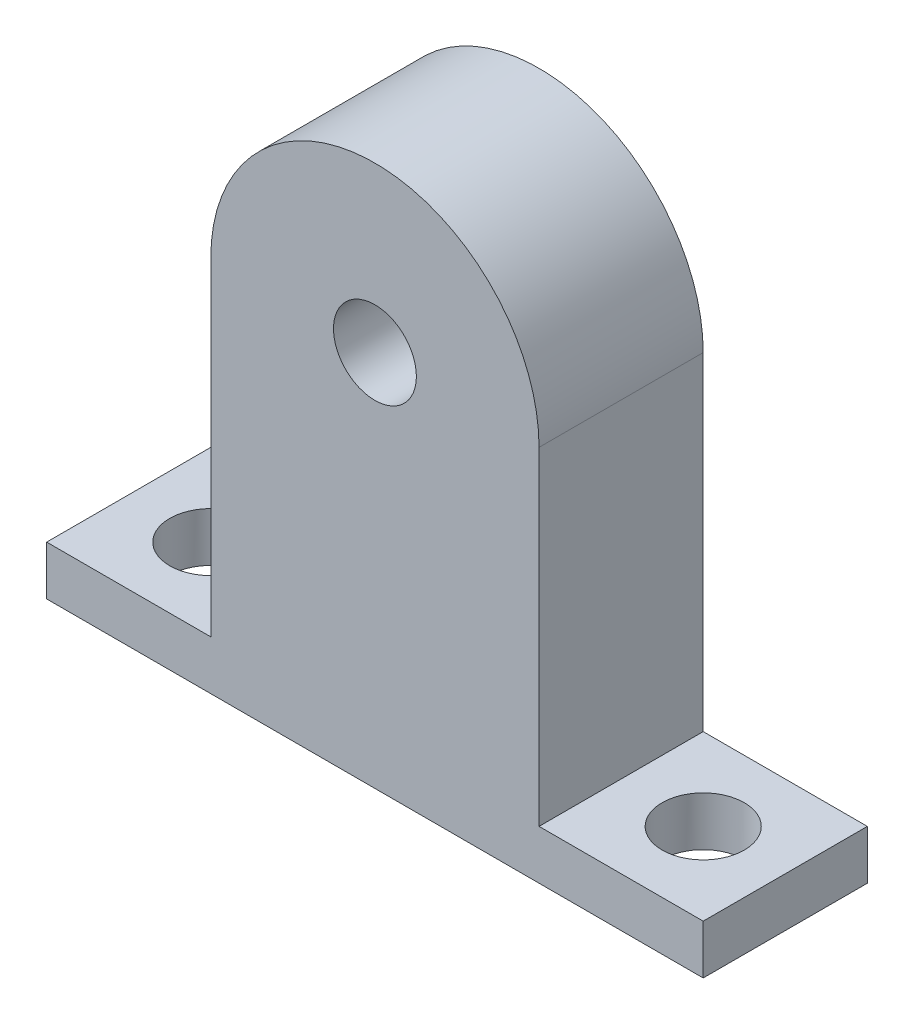
ISO-10303-21;
HEADER;
FILE_DESCRIPTION(('STEP AP214'),'2;1');
FILE_NAME('part.step','',(''),(''),'','','');
FILE_SCHEMA(('AUTOMOTIVE_DESIGN { 1 0 10303 214 1 1 1 1 }'));
ENDSEC;
DATA;
#1=APPLICATION_CONTEXT('core data for automotive mechanical design processes');
#2=APPLICATION_PROTOCOL_DEFINITION('international standard','automotive_design',2000,#1);
#3=PRODUCT_CONTEXT('',#1,'mechanical');
#4=PRODUCT('Part','Part','',(#3));
#5=PRODUCT_RELATED_PRODUCT_CATEGORY('part','',(#4));
#6=PRODUCT_DEFINITION_FORMATION('','',#4);
#7=PRODUCT_DEFINITION_CONTEXT('part definition',#1,'design');
#8=PRODUCT_DEFINITION('design','',#6,#7);
#9=PRODUCT_DEFINITION_SHAPE('','',#8);
#10=(LENGTH_UNIT() NAMED_UNIT(*) SI_UNIT(.MILLI.,.METRE.));
#11=(NAMED_UNIT(*) PLANE_ANGLE_UNIT() SI_UNIT($,.RADIAN.));
#12=(NAMED_UNIT(*) SI_UNIT($,.STERADIAN.) SOLID_ANGLE_UNIT());
#13=UNCERTAINTY_MEASURE_WITH_UNIT(LENGTH_MEASURE(1.E-05),#10,'distance_accuracy_value','');
#14=(GEOMETRIC_REPRESENTATION_CONTEXT(3) GLOBAL_UNCERTAINTY_ASSIGNED_CONTEXT((#13)) GLOBAL_UNIT_ASSIGNED_CONTEXT((#10,
#11,#12)) REPRESENTATION_CONTEXT('',''));
#15=CARTESIAN_POINT('',(0.,0.,0.));
#16=DIRECTION('',(0.,0.,1.));
#17=DIRECTION('',(1.,0.,0.));
#18=AXIS2_PLACEMENT_3D('',#15,#16,#17);
#19=CARTESIAN_POINT('',(0.,7.62,0.));
#20=DIRECTION('',(0.,-1.,0.));
#21=DIRECTION('',(0.,0.,-1.));
#22=AXIS2_PLACEMENT_3D('',#19,#20,#21);
#23=PLANE('',#22);
#24=CARTESIAN_POINT('',(38.1,7.62,0.));
#25=DIRECTION('',(0.,1.,0.));
#26=DIRECTION('',(0.,0.,1.));
#27=AXIS2_PLACEMENT_3D('',#24,#25,#26);
#28=CIRCLE('',#27,6.35635);
#29=CARTESIAN_POINT('',(38.1,7.62,6.35635));
#30=VERTEX_POINT('',#29);
#31=EDGE_CURVE('E156',#30,#30,#28,.T.);
#32=ORIENTED_EDGE('',*,*,#31,.F.);
#33=EDGE_LOOP('',(#32));
#34=FACE_BOUND('',#33,.T.);
#35=DIRECTION('',(0.,0.,-1.));
#36=VECTOR('',#35,1.);
#37=CARTESIAN_POINT('',(25.4,7.61999999999999,12.7));
#38=LINE('',#37,#36);
#39=CARTESIAN_POINT('',(25.4,7.61999999999999,12.7));
#40=VERTEX_POINT('',#39);
#41=CARTESIAN_POINT('',(25.4,7.61999999999999,-12.7));
#42=VERTEX_POINT('',#41);
#43=EDGE_CURVE('E163',#40,#42,#38,.T.);
#44=ORIENTED_EDGE('',*,*,#43,.F.);
#45=DIRECTION('',(1.,0.,0.));
#46=VECTOR('',#45,1.);
#47=CARTESIAN_POINT('',(-50.8,7.62,12.7));
#48=LINE('',#47,#46);
#49=CARTESIAN_POINT('',(50.8,7.62,12.7));
#50=VERTEX_POINT('',#49);
#51=EDGE_CURVE('E72',#40,#50,#48,.T.);
#52=ORIENTED_EDGE('',*,*,#51,.T.);
#53=DIRECTION('',(0.,0.,-1.));
#54=VECTOR('',#53,1.);
#55=CARTESIAN_POINT('',(50.8,7.62,12.7));
#56=LINE('',#55,#54);
#57=CARTESIAN_POINT('',(50.8,7.62,-12.7));
#58=VERTEX_POINT('',#57);
#59=EDGE_CURVE('E168',#50,#58,#56,.T.);
#60=ORIENTED_EDGE('',*,*,#59,.T.);
#61=DIRECTION('',(-1.,0.,0.));
#62=VECTOR('',#61,1.);
#63=CARTESIAN_POINT('',(-50.8,7.62,-12.7));
#64=LINE('',#63,#62);
#65=EDGE_CURVE('E101',#58,#42,#64,.T.);
#66=ORIENTED_EDGE('',*,*,#65,.T.);
#67=EDGE_LOOP('',(#44,#52,#60,#66));
#68=FACE_BOUND('',#67,.T.);
#69=ADVANCED_FACE('F47',(#34,#68),#23,.F.);
#70=CARTESIAN_POINT('',(50.8,7.62,12.7));
#71=DIRECTION('',(-1.,0.,0.));
#72=DIRECTION('',(0.,0.,1.));
#73=AXIS2_PLACEMENT_3D('',#70,#71,#72);
#74=PLANE('',#73);
#75=DIRECTION('',(0.,0.,-1.));
#76=VECTOR('',#75,1.);
#77=CARTESIAN_POINT('',(50.8,0.,12.7));
#78=LINE('',#77,#76);
#79=CARTESIAN_POINT('',(50.8,0.,12.7));
#80=VERTEX_POINT('',#79);
#81=CARTESIAN_POINT('',(50.8,0.,-12.7));
#82=VERTEX_POINT('',#81);
#83=EDGE_CURVE('E143',#80,#82,#78,.T.);
#84=ORIENTED_EDGE('',*,*,#83,.T.);
#85=DIRECTION('',(0.,-1.,0.));
#86=VECTOR('',#85,1.);
#87=CARTESIAN_POINT('',(50.8,7.62,-12.7));
#88=LINE('',#87,#86);
#89=EDGE_CURVE('E11',#58,#82,#88,.T.);
#90=ORIENTED_EDGE('',*,*,#89,.F.);
#91=ORIENTED_EDGE('',*,*,#59,.F.);
#92=DIRECTION('',(0.,-1.,0.));
#93=VECTOR('',#92,1.);
#94=CARTESIAN_POINT('',(50.8,7.62,12.7));
#95=LINE('',#94,#93);
#96=EDGE_CURVE('E180',#50,#80,#95,.T.);
#97=ORIENTED_EDGE('',*,*,#96,.T.);
#98=EDGE_LOOP('',(#84,#90,#91,#97));
#99=FACE_BOUND('',#98,.T.);
#100=ADVANCED_FACE('F49',(#99),#74,.F.);
#101=CARTESIAN_POINT('',(-50.8,7.62,-12.7));
#102=DIRECTION('',(0.,0.,1.));
#103=DIRECTION('',(1.,0.,0.));
#104=AXIS2_PLACEMENT_3D('',#101,#102,#103);
#105=PLANE('',#104);
#106=CARTESIAN_POINT('',(0.,58.42,-12.7));
#107=DIRECTION('',(0.,0.,1.));
#108=DIRECTION('',(1.,0.,0.));
#109=AXIS2_PLACEMENT_3D('',#106,#107,#108);
#110=CIRCLE('',#109,6.4135);
#111=CARTESIAN_POINT('',(6.4135,58.42,-12.7));
#112=VERTEX_POINT('',#111);
#113=EDGE_CURVE('E253',#112,#112,#110,.F.);
#114=ORIENTED_EDGE('',*,*,#113,.F.);
#115=EDGE_LOOP('',(#114));
#116=FACE_BOUND('',#115,.T.);
#117=DIRECTION('',(-1.,0.,0.));
#118=VECTOR('',#117,1.);
#119=CARTESIAN_POINT('',(-50.8,0.,-12.7));
#120=LINE('',#119,#118);
#121=CARTESIAN_POINT('',(-50.8,0.,-12.7));
#122=VERTEX_POINT('',#121);
#123=EDGE_CURVE('E184',#82,#122,#120,.T.);
#124=ORIENTED_EDGE('',*,*,#123,.T.);
#125=DIRECTION('',(0.,-1.,0.));
#126=VECTOR('',#125,1.);
#127=CARTESIAN_POINT('',(-50.8,7.62,-12.7));
#128=LINE('',#127,#126);
#129=CARTESIAN_POINT('',(-50.8,7.62,-12.7));
#130=VERTEX_POINT('',#129);
#131=EDGE_CURVE('E56',#130,#122,#128,.T.);
#132=ORIENTED_EDGE('',*,*,#131,.F.);
#133=CARTESIAN_POINT('',(-25.4,7.62,-12.7));
#134=VERTEX_POINT('',#133);
#135=EDGE_CURVE('E171',#134,#130,#64,.T.);
#136=ORIENTED_EDGE('',*,*,#135,.F.);
#137=DIRECTION('',(0.,1.,0.));
#138=VECTOR('',#137,1.);
#139=CARTESIAN_POINT('',(-25.4,0.,-12.7));
#140=LINE('',#139,#138);
#141=CARTESIAN_POINT('',(-25.4,58.42,-12.7));
#142=VERTEX_POINT('',#141);
#143=EDGE_CURVE('E63',#134,#142,#140,.T.);
#144=ORIENTED_EDGE('',*,*,#143,.T.);
#145=CARTESIAN_POINT('',(0.,58.42,-12.7));
#146=DIRECTION('',(0.,0.,1.));
#147=DIRECTION('',(1.,0.,0.));
#148=AXIS2_PLACEMENT_3D('',#145,#146,#147);
#149=CIRCLE('',#148,25.4);
#150=CARTESIAN_POINT('',(25.4,58.42,-12.7));
#151=VERTEX_POINT('',#150);
#152=EDGE_CURVE('E141',#151,#142,#149,.T.);
#153=ORIENTED_EDGE('',*,*,#152,.F.);
#154=DIRECTION('',(0.,1.,0.));
#155=VECTOR('',#154,1.);
#156=CARTESIAN_POINT('',(25.4,0.,-12.7));
#157=LINE('',#156,#155);
#158=EDGE_CURVE('E135',#42,#151,#157,.T.);
#159=ORIENTED_EDGE('',*,*,#158,.F.);
#160=ORIENTED_EDGE('',*,*,#65,.F.);
#161=ORIENTED_EDGE('',*,*,#89,.T.);
#162=EDGE_LOOP('',(#124,#132,#136,#144,#153,#159,#160,#161));
#163=FACE_BOUND('',#162,.T.);
#164=ADVANCED_FACE('F215',(#116,#163),#105,.F.);
#165=CARTESIAN_POINT('',(-50.8,7.62,12.7));
#166=DIRECTION('',(1.,0.,0.));
#167=DIRECTION('',(0.,0.,-1.));
#168=AXIS2_PLACEMENT_3D('',#165,#166,#167);
#169=PLANE('',#168);
#170=DIRECTION('',(0.,0.,1.));
#171=VECTOR('',#170,1.);
#172=CARTESIAN_POINT('',(-50.8,0.,12.7));
#173=LINE('',#172,#171);
#174=CARTESIAN_POINT('',(-50.8,0.,12.7));
#175=VERTEX_POINT('',#174);
#176=EDGE_CURVE('E187',#122,#175,#173,.T.);
#177=ORIENTED_EDGE('',*,*,#176,.T.);
#178=DIRECTION('',(0.,-1.,0.));
#179=VECTOR('',#178,1.);
#180=CARTESIAN_POINT('',(-50.8,7.62,12.7));
#181=LINE('',#180,#179);
#182=CARTESIAN_POINT('',(-50.8,7.62,12.7));
#183=VERTEX_POINT('',#182);
#184=EDGE_CURVE('E194',#183,#175,#181,.T.);
#185=ORIENTED_EDGE('',*,*,#184,.F.);
#186=DIRECTION('',(0.,0.,1.));
#187=VECTOR('',#186,1.);
#188=CARTESIAN_POINT('',(-50.8,7.62,12.7));
#189=LINE('',#188,#187);
#190=EDGE_CURVE('E174',#130,#183,#189,.T.);
#191=ORIENTED_EDGE('',*,*,#190,.F.);
#192=ORIENTED_EDGE('',*,*,#131,.T.);
#193=EDGE_LOOP('',(#177,#185,#191,#192));
#194=FACE_BOUND('',#193,.T.);
#195=ADVANCED_FACE('F202',(#194),#169,.F.);
#196=CARTESIAN_POINT('',(-50.8,7.62,12.7));
#197=DIRECTION('',(0.,0.,-1.));
#198=DIRECTION('',(-1.,0.,0.));
#199=AXIS2_PLACEMENT_3D('',#196,#197,#198);
#200=PLANE('',#199);
#201=CARTESIAN_POINT('',(0.,58.42,12.7));
#202=DIRECTION('',(0.,0.,1.));
#203=DIRECTION('',(1.,0.,0.));
#204=AXIS2_PLACEMENT_3D('',#201,#202,#203);
#205=CIRCLE('',#204,6.4135);
#206=CARTESIAN_POINT('',(6.4135,58.42,12.7));
#207=VERTEX_POINT('',#206);
#208=EDGE_CURVE('E261',#207,#207,#205,.T.);
#209=ORIENTED_EDGE('',*,*,#208,.F.);
#210=EDGE_LOOP('',(#209));
#211=FACE_BOUND('',#210,.T.);
#212=DIRECTION('',(1.,0.,0.));
#213=VECTOR('',#212,1.);
#214=CARTESIAN_POINT('',(-50.8,0.,12.7));
#215=LINE('',#214,#213);
#216=EDGE_CURVE('E94',#175,#80,#215,.T.);
#217=ORIENTED_EDGE('',*,*,#216,.T.);
#218=ORIENTED_EDGE('',*,*,#96,.F.);
#219=ORIENTED_EDGE('',*,*,#51,.F.);
#220=DIRECTION('',(0.,1.,0.));
#221=VECTOR('',#220,1.);
#222=CARTESIAN_POINT('',(25.4,0.,12.7));
#223=LINE('',#222,#221);
#224=CARTESIAN_POINT('',(25.4,58.42,12.7));
#225=VERTEX_POINT('',#224);
#226=EDGE_CURVE('E130',#40,#225,#223,.T.);
#227=ORIENTED_EDGE('',*,*,#226,.T.);
#228=CARTESIAN_POINT('',(0.,58.42,12.7));
#229=DIRECTION('',(0.,0.,1.));
#230=DIRECTION('',(1.,0.,0.));
#231=AXIS2_PLACEMENT_3D('',#228,#229,#230);
#232=CIRCLE('',#231,25.4);
#233=CARTESIAN_POINT('',(-25.4,58.42,12.7));
#234=VERTEX_POINT('',#233);
#235=EDGE_CURVE('E123',#225,#234,#232,.T.);
#236=ORIENTED_EDGE('',*,*,#235,.T.);
#237=DIRECTION('',(0.,1.,0.));
#238=VECTOR('',#237,1.);
#239=CARTESIAN_POINT('',(-25.4,0.,12.7));
#240=LINE('',#239,#238);
#241=CARTESIAN_POINT('',(-25.4,7.61999999999999,12.7));
#242=VERTEX_POINT('',#241);
#243=EDGE_CURVE('E128',#242,#234,#240,.T.);
#244=ORIENTED_EDGE('',*,*,#243,.F.);
#245=EDGE_CURVE('E177',#183,#242,#48,.T.);
#246=ORIENTED_EDGE('',*,*,#245,.F.);
#247=ORIENTED_EDGE('',*,*,#184,.T.);
#248=EDGE_LOOP('',(#217,#218,#219,#227,#236,#244,#246,#247));
#249=FACE_BOUND('',#248,.T.);
#250=ADVANCED_FACE('F125',(#211,#249),#200,.F.);
#251=CARTESIAN_POINT('',(-38.1,7.62,0.));
#252=DIRECTION('',(0.,-1.,0.));
#253=DIRECTION('',(0.,0.,1.));
#254=AXIS2_PLACEMENT_3D('',#251,#252,#253);
#255=CIRCLE('',#254,6.35635);
#256=CARTESIAN_POINT('',(-38.1,7.62,6.35635));
#257=VERTEX_POINT('',#256);
#258=EDGE_CURVE('E249',#257,#257,#255,.T.);
#259=ORIENTED_EDGE('',*,*,#258,.T.);
#260=EDGE_LOOP('',(#259));
#261=FACE_BOUND('',#260,.T.);
#262=ORIENTED_EDGE('',*,*,#245,.T.);
#263=DIRECTION('',(0.,0.,-1.));
#264=VECTOR('',#263,1.);
#265=CARTESIAN_POINT('',(-25.4,7.61999999999999,12.7));
#266=LINE('',#265,#264);
#267=EDGE_CURVE('E144',#242,#134,#266,.T.);
#268=ORIENTED_EDGE('',*,*,#267,.T.);
#269=ORIENTED_EDGE('',*,*,#135,.T.);
#270=ORIENTED_EDGE('',*,*,#190,.T.);
#271=EDGE_LOOP('',(#262,#268,#269,#270));
#272=FACE_BOUND('',#271,.T.);
#273=ADVANCED_FACE('F214',(#261,#272),#23,.F.);
#274=CARTESIAN_POINT('',(0.,0.,0.));
#275=DIRECTION('',(0.,-1.,0.));
#276=DIRECTION('',(0.,0.,-1.));
#277=AXIS2_PLACEMENT_3D('',#274,#275,#276);
#278=PLANE('',#277);
#279=CARTESIAN_POINT('',(-38.1,0.,0.));
#280=DIRECTION('',(0.,-1.,0.));
#281=DIRECTION('',(0.,0.,-1.));
#282=AXIS2_PLACEMENT_3D('',#279,#280,#281);
#283=CIRCLE('',#282,6.35635);
#284=CARTESIAN_POINT('',(-38.1,0.,-6.35635));
#285=VERTEX_POINT('',#284);
#286=EDGE_CURVE('E252',#285,#285,#283,.T.);
#287=ORIENTED_EDGE('',*,*,#286,.F.);
#288=EDGE_LOOP('',(#287));
#289=FACE_BOUND('',#288,.T.);
#290=CARTESIAN_POINT('',(38.1,0.,0.));
#291=DIRECTION('',(0.,-1.,0.));
#292=DIRECTION('',(0.,0.,-1.));
#293=AXIS2_PLACEMENT_3D('',#290,#291,#292);
#294=CIRCLE('',#293,6.35635);
#295=CARTESIAN_POINT('',(38.1,0.,-6.35635));
#296=VERTEX_POINT('',#295);
#297=EDGE_CURVE('E258',#296,#296,#294,.F.);
#298=ORIENTED_EDGE('',*,*,#297,.T.);
#299=EDGE_LOOP('',(#298));
#300=FACE_BOUND('',#299,.T.);
#301=ORIENTED_EDGE('',*,*,#83,.F.);
#302=ORIENTED_EDGE('',*,*,#216,.F.);
#303=ORIENTED_EDGE('',*,*,#176,.F.);
#304=ORIENTED_EDGE('',*,*,#123,.F.);
#305=EDGE_LOOP('',(#301,#302,#303,#304));
#306=FACE_BOUND('',#305,.T.);
#307=ADVANCED_FACE('F207',(#289,#300,#306),#278,.T.);
#308=CARTESIAN_POINT('',(0.,58.42,12.7));
#309=DIRECTION('',(0.,0.,-1.));
#310=DIRECTION('',(-1.,0.,0.));
#311=AXIS2_PLACEMENT_3D('',#308,#309,#310);
#312=CYLINDRICAL_SURFACE('',#311,25.4);
#313=ORIENTED_EDGE('',*,*,#152,.T.);
#314=DIRECTION('',(0.,0.,-1.));
#315=VECTOR('',#314,1.);
#316=CARTESIAN_POINT('',(-25.4,58.42,12.7));
#317=LINE('',#316,#315);
#318=EDGE_CURVE('E138',#234,#142,#317,.T.);
#319=ORIENTED_EDGE('',*,*,#318,.F.);
#320=ORIENTED_EDGE('',*,*,#235,.F.);
#321=DIRECTION('',(0.,0.,-1.));
#322=VECTOR('',#321,1.);
#323=CARTESIAN_POINT('',(25.4,58.42,12.7));
#324=LINE('',#323,#322);
#325=EDGE_CURVE('E150',#225,#151,#324,.T.);
#326=ORIENTED_EDGE('',*,*,#325,.T.);
#327=EDGE_LOOP('',(#313,#319,#320,#326));
#328=FACE_BOUND('',#327,.T.);
#329=ADVANCED_FACE('F139',(#328),#312,.T.);
#330=CARTESIAN_POINT('',(-25.4,0.,12.7));
#331=DIRECTION('',(-1.,0.,0.));
#332=DIRECTION('',(0.,0.,1.));
#333=AXIS2_PLACEMENT_3D('',#330,#331,#332);
#334=PLANE('',#333);
#335=ORIENTED_EDGE('',*,*,#143,.F.);
#336=ORIENTED_EDGE('',*,*,#267,.F.);
#337=ORIENTED_EDGE('',*,*,#243,.T.);
#338=ORIENTED_EDGE('',*,*,#318,.T.);
#339=EDGE_LOOP('',(#335,#336,#337,#338));
#340=FACE_BOUND('',#339,.T.);
#341=ADVANCED_FACE('F146',(#340),#334,.T.);
#342=CARTESIAN_POINT('',(25.4,0.,12.7));
#343=DIRECTION('',(-1.,0.,0.));
#344=DIRECTION('',(0.,0.,1.));
#345=AXIS2_PLACEMENT_3D('',#342,#343,#344);
#346=PLANE('',#345);
#347=ORIENTED_EDGE('',*,*,#158,.T.);
#348=ORIENTED_EDGE('',*,*,#325,.F.);
#349=ORIENTED_EDGE('',*,*,#226,.F.);
#350=ORIENTED_EDGE('',*,*,#43,.T.);
#351=EDGE_LOOP('',(#347,#348,#349,#350));
#352=FACE_BOUND('',#351,.T.);
#353=ADVANCED_FACE('F217',(#352),#346,.F.);
#354=CARTESIAN_POINT('',(38.1,-0.00100000000000013,0.));
#355=DIRECTION('',(0.,1.,0.));
#356=DIRECTION('',(0.,0.,1.));
#357=AXIS2_PLACEMENT_3D('',#354,#355,#356);
#358=CYLINDRICAL_SURFACE('',#357,6.35635);
#359=ORIENTED_EDGE('',*,*,#297,.F.);
#360=EDGE_LOOP('',(#359));
#361=FACE_BOUND('',#360,.T.);
#362=ORIENTED_EDGE('',*,*,#31,.T.);
#363=EDGE_LOOP('',(#362));
#364=FACE_BOUND('',#363,.T.);
#365=ADVANCED_FACE('F219',(#361,#364),#358,.F.);
#366=CARTESIAN_POINT('',(-38.1,-0.00100000000000013,0.));
#367=DIRECTION('',(0.,1.,0.));
#368=DIRECTION('',(0.,0.,1.));
#369=AXIS2_PLACEMENT_3D('',#366,#367,#368);
#370=CYLINDRICAL_SURFACE('',#369,6.35635);
#371=ORIENTED_EDGE('',*,*,#286,.T.);
#372=EDGE_LOOP('',(#371));
#373=FACE_BOUND('',#372,.T.);
#374=ORIENTED_EDGE('',*,*,#258,.F.);
#375=EDGE_LOOP('',(#374));
#376=FACE_BOUND('',#375,.T.);
#377=ADVANCED_FACE('F226',(#373,#376),#370,.F.);
#378=CARTESIAN_POINT('',(0.,58.42,-12.701));
#379=DIRECTION('',(0.,0.,1.));
#380=DIRECTION('',(1.,0.,0.));
#381=AXIS2_PLACEMENT_3D('',#378,#379,#380);
#382=CYLINDRICAL_SURFACE('',#381,6.4135);
#383=ORIENTED_EDGE('',*,*,#208,.T.);
#384=EDGE_LOOP('',(#383));
#385=FACE_BOUND('',#384,.T.);
#386=ORIENTED_EDGE('',*,*,#113,.T.);
#387=EDGE_LOOP('',(#386));
#388=FACE_BOUND('',#387,.T.);
#389=ADVANCED_FACE('F276',(#385,#388),#382,.F.);
#390=CLOSED_SHELL('',(#69,#100,#164,#195,#250,#273,#307,#329,#341,#353,#365,#377,#389));
#391=MANIFOLD_SOLID_BREP('B2',#390);
#392=ADVANCED_BREP_SHAPE_REPRESENTATION('',(#18,#391),#14);
#393=SHAPE_DEFINITION_REPRESENTATION(#9,#392);
ENDSEC;
END-ISO-10303-21;
